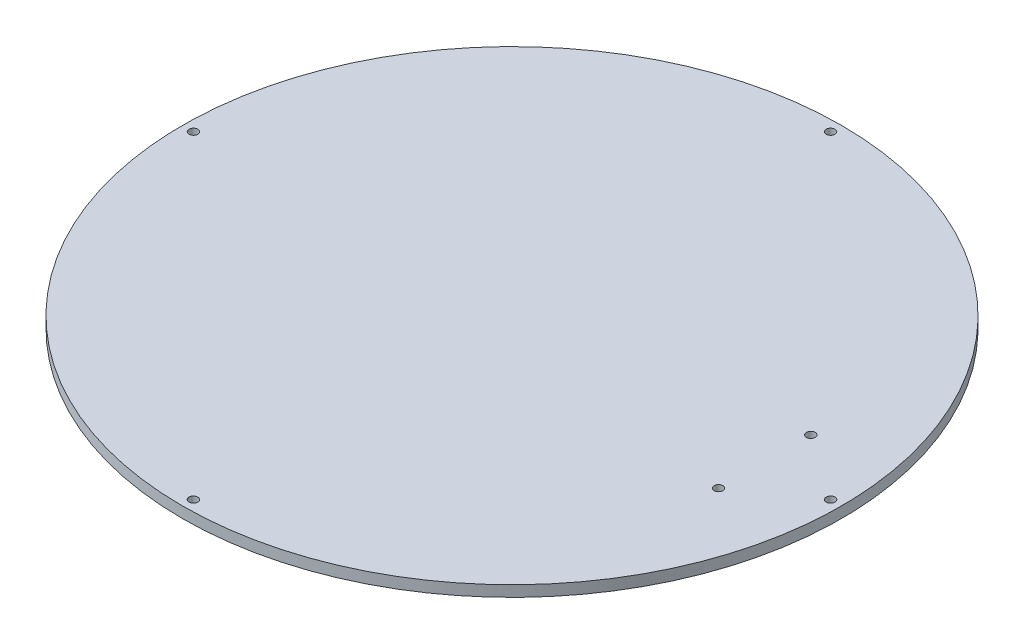
ISO-10303-21;
HEADER;
FILE_DESCRIPTION(('STEP AP214'),'2;1');
FILE_NAME('part.step','',(''),(''),'','','');
FILE_SCHEMA(('AUTOMOTIVE_DESIGN { 1 0 10303 214 1 1 1 1 }'));
ENDSEC;
DATA;
#1=APPLICATION_CONTEXT('core data for automotive mechanical design processes');
#2=APPLICATION_PROTOCOL_DEFINITION('international standard','automotive_design',2000,#1);
#3=PRODUCT_CONTEXT('',#1,'mechanical');
#4=PRODUCT('Part','Part','',(#3));
#5=PRODUCT_RELATED_PRODUCT_CATEGORY('part','',(#4));
#6=PRODUCT_DEFINITION_FORMATION('','',#4);
#7=PRODUCT_DEFINITION_CONTEXT('part definition',#1,'design');
#8=PRODUCT_DEFINITION('design','',#6,#7);
#9=PRODUCT_DEFINITION_SHAPE('','',#8);
#10=(LENGTH_UNIT() NAMED_UNIT(*) SI_UNIT(.MILLI.,.METRE.));
#11=(NAMED_UNIT(*) PLANE_ANGLE_UNIT() SI_UNIT($,.RADIAN.));
#12=(NAMED_UNIT(*) SI_UNIT($,.STERADIAN.) SOLID_ANGLE_UNIT());
#13=UNCERTAINTY_MEASURE_WITH_UNIT(LENGTH_MEASURE(1.E-05),#10,'distance_accuracy_value','');
#14=(GEOMETRIC_REPRESENTATION_CONTEXT(3) GLOBAL_UNCERTAINTY_ASSIGNED_CONTEXT((#13)) GLOBAL_UNIT_ASSIGNED_CONTEXT((#10,
#11,#12)) REPRESENTATION_CONTEXT('',''));
#15=CARTESIAN_POINT('',(0.,0.,0.));
#16=DIRECTION('',(0.,0.,1.));
#17=DIRECTION('',(1.,0.,0.));
#18=AXIS2_PLACEMENT_3D('',#15,#16,#17);
#19=CARTESIAN_POINT('',(0.,10.,0.));
#20=DIRECTION('',(0.,-1.,0.));
#21=DIRECTION('',(0.,0.,-1.));
#22=AXIS2_PLACEMENT_3D('',#19,#20,#21);
#23=CYLINDRICAL_SURFACE('',#22,300.);
#24=CARTESIAN_POINT('',(0.,10.,0.));
#25=DIRECTION('',(0.,1.,0.));
#26=DIRECTION('',(0.,0.,1.));
#27=AXIS2_PLACEMENT_3D('',#24,#25,#26);
#28=CIRCLE('',#27,300.);
#29=CARTESIAN_POINT('',(0.,10.,300.));
#30=VERTEX_POINT('',#29);
#31=EDGE_CURVE('E10',#30,#30,#28,.T.);
#32=ORIENTED_EDGE('',*,*,#31,.F.);
#33=EDGE_LOOP('',(#32));
#34=FACE_BOUND('',#33,.T.);
#35=CARTESIAN_POINT('',(0.,0.,0.));
#36=DIRECTION('',(0.,1.,0.));
#37=DIRECTION('',(0.,0.,1.));
#38=AXIS2_PLACEMENT_3D('',#35,#36,#37);
#39=CIRCLE('',#38,300.);
#40=CARTESIAN_POINT('',(0.,0.,300.));
#41=VERTEX_POINT('',#40);
#42=EDGE_CURVE('E40',#41,#41,#39,.T.);
#43=ORIENTED_EDGE('',*,*,#42,.T.);
#44=EDGE_LOOP('',(#43));
#45=FACE_BOUND('',#44,.T.);
#46=ADVANCED_FACE('F37',(#34,#45),#23,.T.);
#47=CARTESIAN_POINT('',(0.,10.,0.));
#48=DIRECTION('',(0.,1.,0.));
#49=DIRECTION('',(0.,0.,1.));
#50=AXIS2_PLACEMENT_3D('',#47,#48,#49);
#51=PLANE('',#50);
#52=CARTESIAN_POINT('',(290.,10.,0.));
#53=DIRECTION('',(0.,1.,0.));
#54=DIRECTION('',(0.,0.,1.));
#55=AXIS2_PLACEMENT_3D('',#52,#53,#54);
#56=CIRCLE('',#55,3.99999999999999);
#57=CARTESIAN_POINT('',(290.,10.,3.99999999999999));
#58=VERTEX_POINT('',#57);
#59=EDGE_CURVE('E84',#58,#58,#56,.T.);
#60=ORIENTED_EDGE('',*,*,#59,.F.);
#61=EDGE_LOOP('',(#60));
#62=FACE_BOUND('',#61,.T.);
#63=CARTESIAN_POINT('',(230.,10.,-42.));
#64=DIRECTION('',(0.,1.,0.));
#65=DIRECTION('',(0.,0.,-1.));
#66=AXIS2_PLACEMENT_3D('',#63,#64,#65);
#67=CIRCLE('',#66,3.99999999999999);
#68=CARTESIAN_POINT('',(230.,10.,-46.));
#69=VERTEX_POINT('',#68);
#70=EDGE_CURVE('E85',#69,#69,#67,.T.);
#71=ORIENTED_EDGE('',*,*,#70,.F.);
#72=EDGE_LOOP('',(#71));
#73=FACE_BOUND('',#72,.T.);
#74=CARTESIAN_POINT('',(3.03758876479353E-12,10.,-290.));
#75=DIRECTION('',(0.,1.,0.));
#76=DIRECTION('',(0.,0.,1.));
#77=AXIS2_PLACEMENT_3D('',#74,#75,#76);
#78=CIRCLE('',#77,3.99999999999998);
#79=CARTESIAN_POINT('',(3.03758876479353E-12,10.,-286.));
#80=VERTEX_POINT('',#79);
#81=EDGE_CURVE('E51',#80,#80,#78,.T.);
#82=ORIENTED_EDGE('',*,*,#81,.F.);
#83=EDGE_LOOP('',(#82));
#84=FACE_BOUND('',#83,.T.);
#85=CARTESIAN_POINT('',(-290.,10.,-2.02505917652902E-12));
#86=DIRECTION('',(0.,1.,0.));
#87=DIRECTION('',(0.,0.,1.));
#88=AXIS2_PLACEMENT_3D('',#85,#86,#87);
#89=CIRCLE('',#88,3.99999999999999);
#90=CARTESIAN_POINT('',(-290.,10.,3.99999999999796));
#91=VERTEX_POINT('',#90);
#92=EDGE_CURVE('E60',#91,#91,#89,.T.);
#93=ORIENTED_EDGE('',*,*,#92,.F.);
#94=EDGE_LOOP('',(#93));
#95=FACE_BOUND('',#94,.T.);
#96=CARTESIAN_POINT('',(-1.01252958826451E-12,10.,290.));
#97=DIRECTION('',(0.,1.,0.));
#98=DIRECTION('',(0.,0.,1.));
#99=AXIS2_PLACEMENT_3D('',#96,#97,#98);
#100=CIRCLE('',#99,3.99999999999999);
#101=CARTESIAN_POINT('',(-1.01252958826451E-12,10.,294.));
#102=VERTEX_POINT('',#101);
#103=EDGE_CURVE('E68',#102,#102,#100,.T.);
#104=ORIENTED_EDGE('',*,*,#103,.F.);
#105=EDGE_LOOP('',(#104));
#106=FACE_BOUND('',#105,.T.);
#107=CARTESIAN_POINT('',(230.,10.,42.));
#108=DIRECTION('',(0.,1.,0.));
#109=DIRECTION('',(0.,0.,1.));
#110=AXIS2_PLACEMENT_3D('',#107,#108,#109);
#111=CIRCLE('',#110,3.99999999999999);
#112=CARTESIAN_POINT('',(230.,10.,46.));
#113=VERTEX_POINT('',#112);
#114=EDGE_CURVE('E76',#113,#113,#111,.T.);
#115=ORIENTED_EDGE('',*,*,#114,.F.);
#116=EDGE_LOOP('',(#115));
#117=FACE_BOUND('',#116,.T.);
#118=ORIENTED_EDGE('',*,*,#31,.T.);
#119=EDGE_LOOP('',(#118));
#120=FACE_BOUND('',#119,.T.);
#121=ADVANCED_FACE('F109',(#62,#73,#84,#95,#106,#117,#120),#51,.T.);
#122=CARTESIAN_POINT('',(0.,0.,0.));
#123=DIRECTION('',(0.,1.,0.));
#124=DIRECTION('',(0.,0.,1.));
#125=AXIS2_PLACEMENT_3D('',#122,#123,#124);
#126=PLANE('',#125);
#127=CARTESIAN_POINT('',(290.,0.,0.));
#128=DIRECTION('',(0.,1.,0.));
#129=DIRECTION('',(0.,0.,1.));
#130=AXIS2_PLACEMENT_3D('',#127,#128,#129);
#131=CIRCLE('',#130,3.99999999999999);
#132=CARTESIAN_POINT('',(290.,0.,3.99999999999999));
#133=VERTEX_POINT('',#132);
#134=EDGE_CURVE('E49',#133,#133,#131,.T.);
#135=ORIENTED_EDGE('',*,*,#134,.T.);
#136=EDGE_LOOP('',(#135));
#137=FACE_BOUND('',#136,.T.);
#138=CARTESIAN_POINT('',(230.,0.,-42.));
#139=DIRECTION('',(0.,1.,0.));
#140=DIRECTION('',(0.,0.,-1.));
#141=AXIS2_PLACEMENT_3D('',#138,#139,#140);
#142=CIRCLE('',#141,3.99999999999999);
#143=CARTESIAN_POINT('',(230.,0.,-46.));
#144=VERTEX_POINT('',#143);
#145=EDGE_CURVE('E56',#144,#144,#142,.T.);
#146=ORIENTED_EDGE('',*,*,#145,.T.);
#147=EDGE_LOOP('',(#146));
#148=FACE_BOUND('',#147,.T.);
#149=CARTESIAN_POINT('',(3.03758876479353E-12,0.,-290.));
#150=DIRECTION('',(0.,1.,0.));
#151=DIRECTION('',(0.,0.,1.));
#152=AXIS2_PLACEMENT_3D('',#149,#150,#151);
#153=CIRCLE('',#152,3.99999999999998);
#154=CARTESIAN_POINT('',(3.03758876479353E-12,0.,-286.));
#155=VERTEX_POINT('',#154);
#156=EDGE_CURVE('E55',#155,#155,#153,.T.);
#157=ORIENTED_EDGE('',*,*,#156,.T.);
#158=EDGE_LOOP('',(#157));
#159=FACE_BOUND('',#158,.T.);
#160=CARTESIAN_POINT('',(-290.,0.,-2.02505917652902E-12));
#161=DIRECTION('',(0.,1.,0.));
#162=DIRECTION('',(0.,0.,1.));
#163=AXIS2_PLACEMENT_3D('',#160,#161,#162);
#164=CIRCLE('',#163,3.99999999999999);
#165=CARTESIAN_POINT('',(-290.,0.,3.99999999999796));
#166=VERTEX_POINT('',#165);
#167=EDGE_CURVE('E64',#166,#166,#164,.T.);
#168=ORIENTED_EDGE('',*,*,#167,.T.);
#169=EDGE_LOOP('',(#168));
#170=FACE_BOUND('',#169,.T.);
#171=CARTESIAN_POINT('',(-1.01252958826451E-12,0.,290.));
#172=DIRECTION('',(0.,1.,0.));
#173=DIRECTION('',(0.,0.,1.));
#174=AXIS2_PLACEMENT_3D('',#171,#172,#173);
#175=CIRCLE('',#174,3.99999999999999);
#176=CARTESIAN_POINT('',(-1.01252958826451E-12,0.,294.));
#177=VERTEX_POINT('',#176);
#178=EDGE_CURVE('E72',#177,#177,#175,.T.);
#179=ORIENTED_EDGE('',*,*,#178,.T.);
#180=EDGE_LOOP('',(#179));
#181=FACE_BOUND('',#180,.T.);
#182=CARTESIAN_POINT('',(230.,0.,42.));
#183=DIRECTION('',(0.,1.,0.));
#184=DIRECTION('',(0.,0.,1.));
#185=AXIS2_PLACEMENT_3D('',#182,#183,#184);
#186=CIRCLE('',#185,3.99999999999999);
#187=CARTESIAN_POINT('',(230.,0.,46.));
#188=VERTEX_POINT('',#187);
#189=EDGE_CURVE('E80',#188,#188,#186,.T.);
#190=ORIENTED_EDGE('',*,*,#189,.T.);
#191=EDGE_LOOP('',(#190));
#192=FACE_BOUND('',#191,.T.);
#193=ORIENTED_EDGE('',*,*,#42,.F.);
#194=EDGE_LOOP('',(#193));
#195=FACE_BOUND('',#194,.T.);
#196=ADVANCED_FACE('F99',(#137,#148,#159,#170,#181,#192,#195),#126,.F.);
#197=CARTESIAN_POINT('',(230.,0.,42.));
#198=DIRECTION('',(0.,1.,0.));
#199=DIRECTION('',(0.,0.,1.));
#200=AXIS2_PLACEMENT_3D('',#197,#198,#199);
#201=CYLINDRICAL_SURFACE('',#200,3.99999999999999);
#202=ORIENTED_EDGE('',*,*,#189,.F.);
#203=EDGE_LOOP('',(#202));
#204=FACE_BOUND('',#203,.T.);
#205=ORIENTED_EDGE('',*,*,#114,.T.);
#206=EDGE_LOOP('',(#205));
#207=FACE_BOUND('',#206,.T.);
#208=ADVANCED_FACE('F123',(#204,#207),#201,.F.);
#209=CARTESIAN_POINT('',(-1.01252958826451E-12,0.,290.));
#210=DIRECTION('',(0.,1.,0.));
#211=DIRECTION('',(0.,0.,1.));
#212=AXIS2_PLACEMENT_3D('',#209,#210,#211);
#213=CYLINDRICAL_SURFACE('',#212,3.99999999999999);
#214=ORIENTED_EDGE('',*,*,#178,.F.);
#215=EDGE_LOOP('',(#214));
#216=FACE_BOUND('',#215,.T.);
#217=ORIENTED_EDGE('',*,*,#103,.T.);
#218=EDGE_LOOP('',(#217));
#219=FACE_BOUND('',#218,.T.);
#220=ADVANCED_FACE('F125',(#216,#219),#213,.F.);
#221=CARTESIAN_POINT('',(-290.,0.,-2.02505917652902E-12));
#222=DIRECTION('',(0.,1.,0.));
#223=DIRECTION('',(0.,0.,1.));
#224=AXIS2_PLACEMENT_3D('',#221,#222,#223);
#225=CYLINDRICAL_SURFACE('',#224,3.99999999999999);
#226=ORIENTED_EDGE('',*,*,#167,.F.);
#227=EDGE_LOOP('',(#226));
#228=FACE_BOUND('',#227,.T.);
#229=ORIENTED_EDGE('',*,*,#92,.T.);
#230=EDGE_LOOP('',(#229));
#231=FACE_BOUND('',#230,.T.);
#232=ADVANCED_FACE('F132',(#228,#231),#225,.F.);
#233=CARTESIAN_POINT('',(3.03758876479353E-12,0.,-290.));
#234=DIRECTION('',(0.,1.,0.));
#235=DIRECTION('',(0.,0.,1.));
#236=AXIS2_PLACEMENT_3D('',#233,#234,#235);
#237=CYLINDRICAL_SURFACE('',#236,3.99999999999998);
#238=ORIENTED_EDGE('',*,*,#156,.F.);
#239=EDGE_LOOP('',(#238));
#240=FACE_BOUND('',#239,.T.);
#241=ORIENTED_EDGE('',*,*,#81,.T.);
#242=EDGE_LOOP('',(#241));
#243=FACE_BOUND('',#242,.T.);
#244=ADVANCED_FACE('F171',(#240,#243),#237,.F.);
#245=CARTESIAN_POINT('',(230.,0.,-42.));
#246=DIRECTION('',(0.,1.,0.));
#247=DIRECTION('',(0.,0.,1.));
#248=AXIS2_PLACEMENT_3D('',#245,#246,#247);
#249=CYLINDRICAL_SURFACE('',#248,3.99999999999999);
#250=ORIENTED_EDGE('',*,*,#145,.F.);
#251=EDGE_LOOP('',(#250));
#252=FACE_BOUND('',#251,.T.);
#253=ORIENTED_EDGE('',*,*,#70,.T.);
#254=EDGE_LOOP('',(#253));
#255=FACE_BOUND('',#254,.T.);
#256=ADVANCED_FACE('F105',(#252,#255),#249,.F.);
#257=CARTESIAN_POINT('',(290.,0.,0.));
#258=DIRECTION('',(0.,1.,0.));
#259=DIRECTION('',(0.,0.,1.));
#260=AXIS2_PLACEMENT_3D('',#257,#258,#259);
#261=CYLINDRICAL_SURFACE('',#260,3.99999999999999);
#262=ORIENTED_EDGE('',*,*,#134,.F.);
#263=EDGE_LOOP('',(#262));
#264=FACE_BOUND('',#263,.T.);
#265=ORIENTED_EDGE('',*,*,#59,.T.);
#266=EDGE_LOOP('',(#265));
#267=FACE_BOUND('',#266,.T.);
#268=ADVANCED_FACE('F102',(#264,#267),#261,.F.);
#269=CLOSED_SHELL('',(#46,#121,#196,#208,#220,#232,#244,#256,#268));
#270=MANIFOLD_SOLID_BREP('B2',#269);
#271=ADVANCED_BREP_SHAPE_REPRESENTATION('',(#18,#270),#14);
#272=SHAPE_DEFINITION_REPRESENTATION(#9,#271);
ENDSEC;
END-ISO-10303-21;
